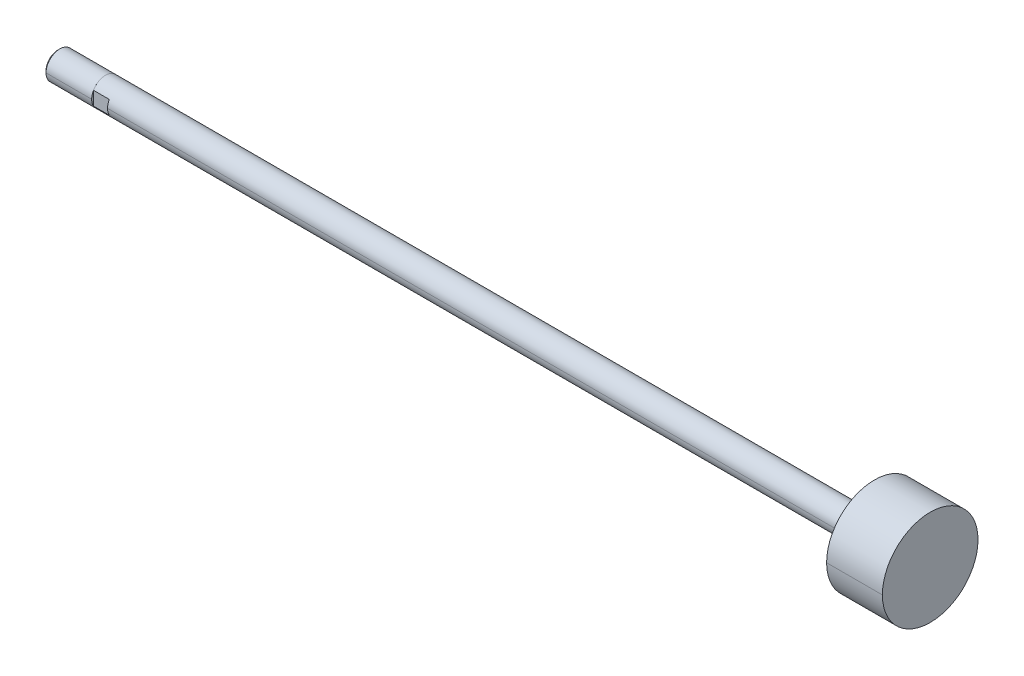
ISO-10303-21;
HEADER;
FILE_DESCRIPTION(('STEP AP214'),'2;1');
FILE_NAME('part.step','',(''),(''),'','','');
FILE_SCHEMA(('AUTOMOTIVE_DESIGN { 1 0 10303 214 1 1 1 1 }'));
ENDSEC;
DATA;
#1=APPLICATION_CONTEXT('core data for automotive mechanical design processes');
#2=APPLICATION_PROTOCOL_DEFINITION('international standard','automotive_design',2000,#1);
#3=PRODUCT_CONTEXT('',#1,'mechanical');
#4=PRODUCT('Part','Part','',(#3));
#5=PRODUCT_RELATED_PRODUCT_CATEGORY('part','',(#4));
#6=PRODUCT_DEFINITION_FORMATION('','',#4);
#7=PRODUCT_DEFINITION_CONTEXT('part definition',#1,'design');
#8=PRODUCT_DEFINITION('design','',#6,#7);
#9=PRODUCT_DEFINITION_SHAPE('','',#8);
#10=(LENGTH_UNIT() NAMED_UNIT(*) SI_UNIT(.MILLI.,.METRE.));
#11=(NAMED_UNIT(*) PLANE_ANGLE_UNIT() SI_UNIT($,.RADIAN.));
#12=(NAMED_UNIT(*) SI_UNIT($,.STERADIAN.) SOLID_ANGLE_UNIT());
#13=UNCERTAINTY_MEASURE_WITH_UNIT(LENGTH_MEASURE(1.E-05),#10,'distance_accuracy_value','');
#14=(GEOMETRIC_REPRESENTATION_CONTEXT(3) GLOBAL_UNCERTAINTY_ASSIGNED_CONTEXT((#13)) GLOBAL_UNIT_ASSIGNED_CONTEXT((#10,
#11,#12)) REPRESENTATION_CONTEXT('',''));
#15=CARTESIAN_POINT('',(0.,0.,0.));
#16=DIRECTION('',(0.,0.,1.));
#17=DIRECTION('',(1.,0.,0.));
#18=AXIS2_PLACEMENT_3D('',#15,#16,#17);
#19=CARTESIAN_POINT('',(323.977,0.,0.));
#20=DIRECTION('',(-1.,0.,0.));
#21=DIRECTION('',(0.,-1.,0.));
#22=AXIS2_PLACEMENT_3D('',#19,#20,#21);
#23=CYLINDRICAL_SURFACE('',#22,5.5499);
#24=CARTESIAN_POINT('',(301.625,0.,0.));
#25=DIRECTION('',(1.,0.,0.));
#26=DIRECTION('',(0.,0.,-1.));
#27=AXIS2_PLACEMENT_3D('',#24,#25,#26);
#28=CIRCLE('',#27,5.5499);
#29=CARTESIAN_POINT('',(301.625,0.,-5.5499));
#30=VERTEX_POINT('',#29);
#31=CARTESIAN_POINT('',(301.625,0.,5.5499));
#32=VERTEX_POINT('',#31);
#33=EDGE_CURVE('E11',#30,#32,#28,.T.);
#34=ORIENTED_EDGE('',*,*,#33,.F.);
#35=DIRECTION('',(-1.,0.,0.));
#36=VECTOR('',#35,1.);
#37=CARTESIAN_POINT('',(301.625,0.,-5.5499));
#38=LINE('',#37,#36);
#39=CARTESIAN_POINT('',(0.,0.,-5.5499));
#40=VERTEX_POINT('',#39);
#41=EDGE_CURVE('E25',#30,#40,#38,.T.);
#42=ORIENTED_EDGE('',*,*,#41,.T.);
#43=CARTESIAN_POINT('',(0.,0.,0.));
#44=DIRECTION('',(1.,0.,0.));
#45=DIRECTION('',(0.,0.,-1.));
#46=AXIS2_PLACEMENT_3D('',#43,#44,#45);
#47=CIRCLE('',#46,5.5499);
#48=CARTESIAN_POINT('',(0.,2.74064116768321,-4.826));
#49=VERTEX_POINT('',#48);
#50=EDGE_CURVE('E245',#40,#49,#47,.T.);
#51=ORIENTED_EDGE('',*,*,#50,.T.);
#52=DIRECTION('',(1.,0.,0.));
#53=VECTOR('',#52,1.);
#54=CARTESIAN_POINT('',(323.977,2.74064116768321,-4.826));
#55=LINE('',#54,#53);
#56=CARTESIAN_POINT('',(-6.35,2.74064116768321,-4.826));
#57=VERTEX_POINT('',#56);
#58=EDGE_CURVE('E240',#57,#49,#55,.T.);
#59=ORIENTED_EDGE('',*,*,#58,.F.);
#60=CARTESIAN_POINT('',(-6.35000000000003,0.,0.));
#61=DIRECTION('',(1.,0.,0.));
#62=DIRECTION('',(0.,0.,-1.));
#63=AXIS2_PLACEMENT_3D('',#60,#61,#62);
#64=CIRCLE('',#63,5.5499);
#65=CARTESIAN_POINT('',(-6.35000000000003,2.74064116768321,4.826));
#66=VERTEX_POINT('',#65);
#67=EDGE_CURVE('E236',#57,#66,#64,.T.);
#68=ORIENTED_EDGE('',*,*,#67,.T.);
#69=DIRECTION('',(1.,0.,0.));
#70=VECTOR('',#69,1.);
#71=CARTESIAN_POINT('',(323.977,2.74064116768321,4.826));
#72=LINE('',#71,#70);
#73=CARTESIAN_POINT('',(0.,2.74064116768321,4.826));
#74=VERTEX_POINT('',#73);
#75=EDGE_CURVE('E232',#66,#74,#72,.T.);
#76=ORIENTED_EDGE('',*,*,#75,.T.);
#77=CARTESIAN_POINT('',(0.,0.,0.));
#78=DIRECTION('',(1.,0.,0.));
#79=DIRECTION('',(0.,0.,-1.));
#80=AXIS2_PLACEMENT_3D('',#77,#78,#79);
#81=CIRCLE('',#80,5.5499);
#82=CARTESIAN_POINT('',(0.,0.,5.5499));
#83=VERTEX_POINT('',#82);
#84=EDGE_CURVE('E228',#74,#83,#81,.T.);
#85=ORIENTED_EDGE('',*,*,#84,.T.);
#86=DIRECTION('',(-1.,0.,0.));
#87=VECTOR('',#86,1.);
#88=CARTESIAN_POINT('',(301.625,0.,5.5499));
#89=LINE('',#88,#87);
#90=EDGE_CURVE('E223',#32,#83,#89,.T.);
#91=ORIENTED_EDGE('',*,*,#90,.F.);
#92=EDGE_LOOP('',(#34,#42,#51,#59,#68,#76,#85,#91));
#93=FACE_BOUND('',#92,.T.);
#94=ADVANCED_FACE('F17',(#93),#23,.T.);
#95=CARTESIAN_POINT('',(323.977,0.,0.));
#96=DIRECTION('',(-1.,0.,0.));
#97=DIRECTION('',(0.,1.,0.));
#98=AXIS2_PLACEMENT_3D('',#95,#96,#97);
#99=CYLINDRICAL_SURFACE('',#98,5.5499);
#100=CARTESIAN_POINT('',(0.,0.,0.));
#101=DIRECTION('',(1.,0.,0.));
#102=DIRECTION('',(0.,0.,-1.));
#103=AXIS2_PLACEMENT_3D('',#100,#101,#102);
#104=CIRCLE('',#103,5.5499);
#105=CARTESIAN_POINT('',(0.,-2.74064116768321,4.826));
#106=VERTEX_POINT('',#105);
#107=EDGE_CURVE('E219',#83,#106,#104,.T.);
#108=ORIENTED_EDGE('',*,*,#107,.T.);
#109=DIRECTION('',(1.,0.,0.));
#110=VECTOR('',#109,1.);
#111=CARTESIAN_POINT('',(323.977,-2.74064116768321,4.826));
#112=LINE('',#111,#110);
#113=CARTESIAN_POINT('',(-6.35,-2.74064116768321,4.826));
#114=VERTEX_POINT('',#113);
#115=EDGE_CURVE('E214',#114,#106,#112,.T.);
#116=ORIENTED_EDGE('',*,*,#115,.F.);
#117=CARTESIAN_POINT('',(-6.35000000000003,0.,0.));
#118=DIRECTION('',(1.,0.,0.));
#119=DIRECTION('',(0.,0.,-1.));
#120=AXIS2_PLACEMENT_3D('',#117,#118,#119);
#121=CIRCLE('',#120,5.5499);
#122=CARTESIAN_POINT('',(-6.35000000000003,-2.74064116768321,-4.826));
#123=VERTEX_POINT('',#122);
#124=EDGE_CURVE('E210',#114,#123,#121,.T.);
#125=ORIENTED_EDGE('',*,*,#124,.T.);
#126=DIRECTION('',(1.,0.,0.));
#127=VECTOR('',#126,1.);
#128=CARTESIAN_POINT('',(323.977,-2.74064116768321,-4.826));
#129=LINE('',#128,#127);
#130=CARTESIAN_POINT('',(0.,-2.74064116768321,-4.826));
#131=VERTEX_POINT('',#130);
#132=EDGE_CURVE('E206',#123,#131,#129,.T.);
#133=ORIENTED_EDGE('',*,*,#132,.T.);
#134=CARTESIAN_POINT('',(0.,0.,0.));
#135=DIRECTION('',(1.,0.,0.));
#136=DIRECTION('',(0.,0.,-1.));
#137=AXIS2_PLACEMENT_3D('',#134,#135,#136);
#138=CIRCLE('',#137,5.5499);
#139=EDGE_CURVE('E202',#131,#40,#138,.T.);
#140=ORIENTED_EDGE('',*,*,#139,.T.);
#141=ORIENTED_EDGE('',*,*,#41,.F.);
#142=CARTESIAN_POINT('',(301.625,0.,0.));
#143=DIRECTION('',(1.,0.,0.));
#144=DIRECTION('',(0.,0.,-1.));
#145=AXIS2_PLACEMENT_3D('',#142,#143,#144);
#146=CIRCLE('',#145,5.5499);
#147=EDGE_CURVE('E197',#32,#30,#146,.T.);
#148=ORIENTED_EDGE('',*,*,#147,.F.);
#149=ORIENTED_EDGE('',*,*,#90,.T.);
#150=EDGE_LOOP('',(#108,#116,#125,#133,#140,#141,#148,#149));
#151=FACE_BOUND('',#150,.T.);
#152=ADVANCED_FACE('F277',(#151),#99,.T.);
#153=CARTESIAN_POINT('',(301.625,5.5499,0.));
#154=DIRECTION('',(1.,0.,0.));
#155=DIRECTION('',(0.,0.,-1.));
#156=AXIS2_PLACEMENT_3D('',#153,#154,#155);
#157=PLANE('',#156);
#158=CARTESIAN_POINT('',(301.625,0.,0.));
#159=DIRECTION('',(1.,0.,0.));
#160=DIRECTION('',(0.,0.,-1.));
#161=AXIS2_PLACEMENT_3D('',#158,#159,#160);
#162=CIRCLE('',#161,19.14525);
#163=CARTESIAN_POINT('',(301.625,0.,-19.14525));
#164=VERTEX_POINT('',#163);
#165=CARTESIAN_POINT('',(301.625,0.,19.14525));
#166=VERTEX_POINT('',#165);
#167=EDGE_CURVE('E192',#164,#166,#162,.T.);
#168=ORIENTED_EDGE('',*,*,#167,.F.);
#169=CARTESIAN_POINT('',(301.625,0.,0.));
#170=DIRECTION('',(1.,0.,0.));
#171=DIRECTION('',(0.,0.,-1.));
#172=AXIS2_PLACEMENT_3D('',#169,#170,#171);
#173=CIRCLE('',#172,19.14525);
#174=EDGE_CURVE('E187',#166,#164,#173,.T.);
#175=ORIENTED_EDGE('',*,*,#174,.F.);
#176=EDGE_LOOP('',(#168,#175));
#177=FACE_BOUND('',#176,.T.);
#178=ORIENTED_EDGE('',*,*,#33,.T.);
#179=ORIENTED_EDGE('',*,*,#147,.T.);
#180=EDGE_LOOP('',(#178,#179));
#181=FACE_BOUND('',#180,.T.);
#182=ADVANCED_FACE('F280',(#177,#181),#157,.F.);
#183=CARTESIAN_POINT('',(323.977,0.,0.));
#184=DIRECTION('',(-1.,0.,0.));
#185=DIRECTION('',(0.,1.,0.));
#186=AXIS2_PLACEMENT_3D('',#183,#184,#185);
#187=CYLINDRICAL_SURFACE('',#186,19.14525);
#188=ORIENTED_EDGE('',*,*,#174,.T.);
#189=DIRECTION('',(-1.,0.,0.));
#190=VECTOR('',#189,1.);
#191=CARTESIAN_POINT('',(323.977,0.,-19.14525));
#192=LINE('',#191,#190);
#193=CARTESIAN_POINT('',(323.977,0.,-19.14525));
#194=VERTEX_POINT('',#193);
#195=EDGE_CURVE('E182',#194,#164,#192,.T.);
#196=ORIENTED_EDGE('',*,*,#195,.F.);
#197=CARTESIAN_POINT('',(323.977,0.,0.));
#198=DIRECTION('',(1.,0.,0.));
#199=DIRECTION('',(0.,0.,-1.));
#200=AXIS2_PLACEMENT_3D('',#197,#198,#199);
#201=CIRCLE('',#200,19.14525);
#202=CARTESIAN_POINT('',(323.977,0.,19.14525));
#203=VERTEX_POINT('',#202);
#204=EDGE_CURVE('E177',#203,#194,#201,.T.);
#205=ORIENTED_EDGE('',*,*,#204,.F.);
#206=DIRECTION('',(-1.,0.,0.));
#207=VECTOR('',#206,1.);
#208=CARTESIAN_POINT('',(323.977,0.,19.14525));
#209=LINE('',#208,#207);
#210=EDGE_CURVE('E172',#203,#166,#209,.T.);
#211=ORIENTED_EDGE('',*,*,#210,.T.);
#212=EDGE_LOOP('',(#188,#196,#205,#211));
#213=FACE_BOUND('',#212,.T.);
#214=ADVANCED_FACE('F282',(#213),#187,.T.);
#215=CARTESIAN_POINT('',(323.977,0.,0.));
#216=DIRECTION('',(-1.,0.,0.));
#217=DIRECTION('',(0.,-1.,0.));
#218=AXIS2_PLACEMENT_3D('',#215,#216,#217);
#219=CYLINDRICAL_SURFACE('',#218,19.14525);
#220=CARTESIAN_POINT('',(323.977,0.,0.));
#221=DIRECTION('',(1.,0.,0.));
#222=DIRECTION('',(0.,0.,-1.));
#223=AXIS2_PLACEMENT_3D('',#220,#221,#222);
#224=CIRCLE('',#223,19.14525);
#225=EDGE_CURVE('E167',#194,#203,#224,.T.);
#226=ORIENTED_EDGE('',*,*,#225,.F.);
#227=ORIENTED_EDGE('',*,*,#195,.T.);
#228=ORIENTED_EDGE('',*,*,#167,.T.);
#229=ORIENTED_EDGE('',*,*,#210,.F.);
#230=EDGE_LOOP('',(#226,#227,#228,#229));
#231=FACE_BOUND('',#230,.T.);
#232=ADVANCED_FACE('F290',(#231),#219,.T.);
#233=CARTESIAN_POINT('',(323.977,19.14525,0.));
#234=DIRECTION('',(-1.,0.,0.));
#235=DIRECTION('',(0.,0.,1.));
#236=AXIS2_PLACEMENT_3D('',#233,#234,#235);
#237=PLANE('',#236);
#238=ORIENTED_EDGE('',*,*,#225,.T.);
#239=ORIENTED_EDGE('',*,*,#204,.T.);
#240=EDGE_LOOP('',(#238,#239));
#241=FACE_BOUND('',#240,.T.);
#242=ADVANCED_FACE('F324',(#241),#237,.F.);
#243=CARTESIAN_POINT('',(0.,0.,0.));
#244=DIRECTION('',(1.,0.,0.));
#245=DIRECTION('',(0.,0.,-1.));
#246=AXIS2_PLACEMENT_3D('',#243,#244,#245);
#247=PLANE('',#246);
#248=DIRECTION('',(0.,1.,0.));
#249=VECTOR('',#248,1.);
#250=CARTESIAN_POINT('',(0.,-5.5499,-4.826));
#251=LINE('',#250,#249);
#252=EDGE_CURVE('E162',#131,#49,#251,.T.);
#253=ORIENTED_EDGE('',*,*,#252,.T.);
#254=ORIENTED_EDGE('',*,*,#50,.F.);
#255=ORIENTED_EDGE('',*,*,#139,.F.);
#256=EDGE_LOOP('',(#253,#254,#255));
#257=FACE_BOUND('',#256,.T.);
#258=ADVANCED_FACE('F257',(#257),#247,.F.);
#259=CARTESIAN_POINT('',(0.,-5.5499,-4.826));
#260=DIRECTION('',(0.,0.,1.));
#261=DIRECTION('',(1.,0.,0.));
#262=AXIS2_PLACEMENT_3D('',#259,#260,#261);
#263=PLANE('',#262);
#264=DIRECTION('',(0.,1.,0.));
#265=VECTOR('',#264,1.);
#266=CARTESIAN_POINT('',(-6.35,-5.5499,-4.826));
#267=LINE('',#266,#265);
#268=EDGE_CURVE('E157',#123,#57,#267,.T.);
#269=ORIENTED_EDGE('',*,*,#268,.T.);
#270=ORIENTED_EDGE('',*,*,#58,.T.);
#271=ORIENTED_EDGE('',*,*,#252,.F.);
#272=ORIENTED_EDGE('',*,*,#132,.F.);
#273=EDGE_LOOP('',(#269,#270,#271,#272));
#274=FACE_BOUND('',#273,.T.);
#275=ADVANCED_FACE('F260',(#274),#263,.F.);
#276=CARTESIAN_POINT('',(-6.35,5.55625,0.));
#277=DIRECTION('',(-1.,0.,0.));
#278=DIRECTION('',(0.,0.,1.));
#279=AXIS2_PLACEMENT_3D('',#276,#277,#278);
#280=PLANE('',#279);
#281=ORIENTED_EDGE('',*,*,#67,.F.);
#282=ORIENTED_EDGE('',*,*,#268,.F.);
#283=ORIENTED_EDGE('',*,*,#124,.F.);
#284=DIRECTION('',(0.,-1.,0.));
#285=VECTOR('',#284,1.);
#286=CARTESIAN_POINT('',(-6.35,5.5499,4.826));
#287=LINE('',#286,#285);
#288=EDGE_CURVE('E152',#66,#114,#287,.T.);
#289=ORIENTED_EDGE('',*,*,#288,.F.);
#290=EDGE_LOOP('',(#281,#282,#283,#289));
#291=FACE_BOUND('',#290,.T.);
#292=CARTESIAN_POINT('',(-6.35,0.,0.));
#293=DIRECTION('',(1.,0.,0.));
#294=DIRECTION('',(0.,0.,-1.));
#295=AXIS2_PLACEMENT_3D('',#292,#293,#294);
#296=CIRCLE('',#295,5.55625);
#297=CARTESIAN_POINT('',(-6.35,0.,-5.55625));
#298=VERTEX_POINT('',#297);
#299=CARTESIAN_POINT('',(-6.35,0.,5.55625));
#300=VERTEX_POINT('',#299);
#301=EDGE_CURVE('E148',#298,#300,#296,.T.);
#302=ORIENTED_EDGE('',*,*,#301,.T.);
#303=CARTESIAN_POINT('',(-6.35,0.,0.));
#304=DIRECTION('',(1.,0.,0.));
#305=DIRECTION('',(0.,0.,-1.));
#306=AXIS2_PLACEMENT_3D('',#303,#304,#305);
#307=CIRCLE('',#306,5.55625);
#308=EDGE_CURVE('E144',#300,#298,#307,.T.);
#309=ORIENTED_EDGE('',*,*,#308,.T.);
#310=EDGE_LOOP('',(#302,#309));
#311=FACE_BOUND('',#310,.T.);
#312=ADVANCED_FACE('F266',(#291,#311),#280,.F.);
#313=CARTESIAN_POINT('',(-6.35,0.,0.));
#314=DIRECTION('',(-1.,0.,0.));
#315=DIRECTION('',(0.,1.,0.));
#316=AXIS2_PLACEMENT_3D('',#313,#314,#315);
#317=CYLINDRICAL_SURFACE('',#316,5.55625);
#318=CARTESIAN_POINT('',(-24.64435,0.,0.));
#319=DIRECTION('',(1.,0.,0.));
#320=DIRECTION('',(0.,0.,-1.));
#321=AXIS2_PLACEMENT_3D('',#318,#319,#320);
#322=CIRCLE('',#321,5.55625);
#323=CARTESIAN_POINT('',(-24.6443500000019,0.,5.55625000000193));
#324=VERTEX_POINT('',#323);
#325=CARTESIAN_POINT('',(-24.64435,0.,-5.55625));
#326=VERTEX_POINT('',#325);
#327=EDGE_CURVE('E110',#324,#326,#322,.T.);
#328=ORIENTED_EDGE('',*,*,#327,.T.);
#329=DIRECTION('',(-1.,0.,0.));
#330=VECTOR('',#329,1.);
#331=CARTESIAN_POINT('',(-6.35,0.,-5.55625));
#332=LINE('',#331,#330);
#333=EDGE_CURVE('E136',#298,#326,#332,.T.);
#334=ORIENTED_EDGE('',*,*,#333,.F.);
#335=ORIENTED_EDGE('',*,*,#308,.F.);
#336=DIRECTION('',(-1.,0.,0.));
#337=VECTOR('',#336,1.);
#338=CARTESIAN_POINT('',(-6.35,0.,5.55625));
#339=LINE('',#338,#337);
#340=EDGE_CURVE('E132',#300,#324,#339,.T.);
#341=ORIENTED_EDGE('',*,*,#340,.T.);
#342=EDGE_LOOP('',(#328,#334,#335,#341));
#343=FACE_BOUND('',#342,.T.);
#344=ADVANCED_FACE('F359',(#343),#317,.T.);
#345=CARTESIAN_POINT('',(-6.35,0.,0.));
#346=DIRECTION('',(-1.,0.,0.));
#347=DIRECTION('',(0.,-1.,0.));
#348=AXIS2_PLACEMENT_3D('',#345,#346,#347);
#349=CYLINDRICAL_SURFACE('',#348,5.55625);
#350=ORIENTED_EDGE('',*,*,#301,.F.);
#351=ORIENTED_EDGE('',*,*,#333,.T.);
#352=CARTESIAN_POINT('',(-24.64435,0.,0.));
#353=DIRECTION('',(1.,0.,0.));
#354=DIRECTION('',(0.,0.,-1.));
#355=AXIS2_PLACEMENT_3D('',#352,#353,#354);
#356=CIRCLE('',#355,5.55625);
#357=EDGE_CURVE('E127',#326,#324,#356,.T.);
#358=ORIENTED_EDGE('',*,*,#357,.T.);
#359=ORIENTED_EDGE('',*,*,#340,.F.);
#360=EDGE_LOOP('',(#350,#351,#358,#359));
#361=FACE_BOUND('',#360,.T.);
#362=ADVANCED_FACE('F368',(#361),#349,.T.);
#363=CARTESIAN_POINT('',(-25.4,0.,0.));
#364=DIRECTION('',(1.,0.,0.));
#365=DIRECTION('',(0.,-1.,0.));
#366=AXIS2_PLACEMENT_3D('',#363,#364,#365);
#367=CONICAL_SURFACE('',#366,4.8006,0.7853981634);
#368=ORIENTED_EDGE('',*,*,#357,.F.);
#369=DIRECTION('',(0.707106781184746,0.,-0.707106781188349));
#370=VECTOR('',#369,1.);
#371=CARTESIAN_POINT('',(-25.4,0.,-4.8006));
#372=LINE('',#371,#370);
#373=CARTESIAN_POINT('',(-25.4,0.,-4.8006));
#374=VERTEX_POINT('',#373);
#375=EDGE_CURVE('E102',#374,#326,#372,.T.);
#376=ORIENTED_EDGE('',*,*,#375,.F.);
#377=CARTESIAN_POINT('',(-25.4,0.,0.));
#378=DIRECTION('',(1.,0.,0.));
#379=DIRECTION('',(0.,0.,-1.));
#380=AXIS2_PLACEMENT_3D('',#377,#378,#379);
#381=CIRCLE('',#380,4.8006);
#382=CARTESIAN_POINT('',(-25.4,0.,4.8006));
#383=VERTEX_POINT('',#382);
#384=EDGE_CURVE('E95',#374,#383,#381,.T.);
#385=ORIENTED_EDGE('',*,*,#384,.T.);
#386=DIRECTION('',(0.707106781184746,0.,0.707106781188349));
#387=VECTOR('',#386,1.);
#388=CARTESIAN_POINT('',(-25.4,0.,4.8006));
#389=LINE('',#388,#387);
#390=EDGE_CURVE('E99',#383,#324,#389,.T.);
#391=ORIENTED_EDGE('',*,*,#390,.T.);
#392=EDGE_LOOP('',(#368,#376,#385,#391));
#393=FACE_BOUND('',#392,.T.);
#394=ADVANCED_FACE('F98',(#393),#367,.T.);
#395=CARTESIAN_POINT('',(-25.4,0.,0.));
#396=DIRECTION('',(1.,0.,0.));
#397=DIRECTION('',(0.,1.,0.));
#398=AXIS2_PLACEMENT_3D('',#395,#396,#397);
#399=CONICAL_SURFACE('',#398,4.8006,0.7853981634);
#400=CARTESIAN_POINT('',(-25.4,0.,0.));
#401=DIRECTION('',(1.,0.,0.));
#402=DIRECTION('',(0.,0.,-1.));
#403=AXIS2_PLACEMENT_3D('',#400,#401,#402);
#404=CIRCLE('',#403,4.8006);
#405=EDGE_CURVE('E109',#383,#374,#404,.T.);
#406=ORIENTED_EDGE('',*,*,#405,.T.);
#407=ORIENTED_EDGE('',*,*,#375,.T.);
#408=ORIENTED_EDGE('',*,*,#327,.F.);
#409=ORIENTED_EDGE('',*,*,#390,.F.);
#410=EDGE_LOOP('',(#406,#407,#408,#409));
#411=FACE_BOUND('',#410,.T.);
#412=ADVANCED_FACE('F108',(#411),#399,.T.);
#413=CARTESIAN_POINT('',(-25.4,0.,0.));
#414=DIRECTION('',(1.,0.,0.));
#415=DIRECTION('',(0.,0.,-1.));
#416=AXIS2_PLACEMENT_3D('',#413,#414,#415);
#417=PLANE('',#416);
#418=ORIENTED_EDGE('',*,*,#384,.F.);
#419=ORIENTED_EDGE('',*,*,#405,.F.);
#420=EDGE_LOOP('',(#418,#419));
#421=FACE_BOUND('',#420,.T.);
#422=ADVANCED_FACE('F112',(#421),#417,.F.);
#423=CARTESIAN_POINT('',(0.,5.5499,4.826));
#424=DIRECTION('',(0.,0.,-1.));
#425=DIRECTION('',(-1.,0.,0.));
#426=AXIS2_PLACEMENT_3D('',#423,#424,#425);
#427=PLANE('',#426);
#428=ORIENTED_EDGE('',*,*,#288,.T.);
#429=ORIENTED_EDGE('',*,*,#115,.T.);
#430=DIRECTION('',(0.,-1.,0.));
#431=VECTOR('',#430,1.);
#432=CARTESIAN_POINT('',(0.,5.5499,4.826));
#433=LINE('',#432,#431);
#434=EDGE_CURVE('E113',#74,#106,#433,.T.);
#435=ORIENTED_EDGE('',*,*,#434,.F.);
#436=ORIENTED_EDGE('',*,*,#75,.F.);
#437=EDGE_LOOP('',(#428,#429,#435,#436));
#438=FACE_BOUND('',#437,.T.);
#439=ADVANCED_FACE('F272',(#438),#427,.F.);
#440=CARTESIAN_POINT('',(0.,0.,0.));
#441=DIRECTION('',(1.,0.,0.));
#442=DIRECTION('',(0.,0.,-1.));
#443=AXIS2_PLACEMENT_3D('',#440,#441,#442);
#444=PLANE('',#443);
#445=ORIENTED_EDGE('',*,*,#434,.T.);
#446=ORIENTED_EDGE('',*,*,#107,.F.);
#447=ORIENTED_EDGE('',*,*,#84,.F.);
#448=EDGE_LOOP('',(#445,#446,#447));
#449=FACE_BOUND('',#448,.T.);
#450=ADVANCED_FACE('F275',(#449),#444,.F.);
#451=CLOSED_SHELL('',(#94,#152,#182,#214,#232,#242,#258,#275,#312,#344,#362,#394,#412,#422,#439,#450));
#452=MANIFOLD_SOLID_BREP('B1',#451);
#453=ADVANCED_BREP_SHAPE_REPRESENTATION('',(#18,#452),#14);
#454=SHAPE_DEFINITION_REPRESENTATION(#9,#453);
ENDSEC;
END-ISO-10303-21;
